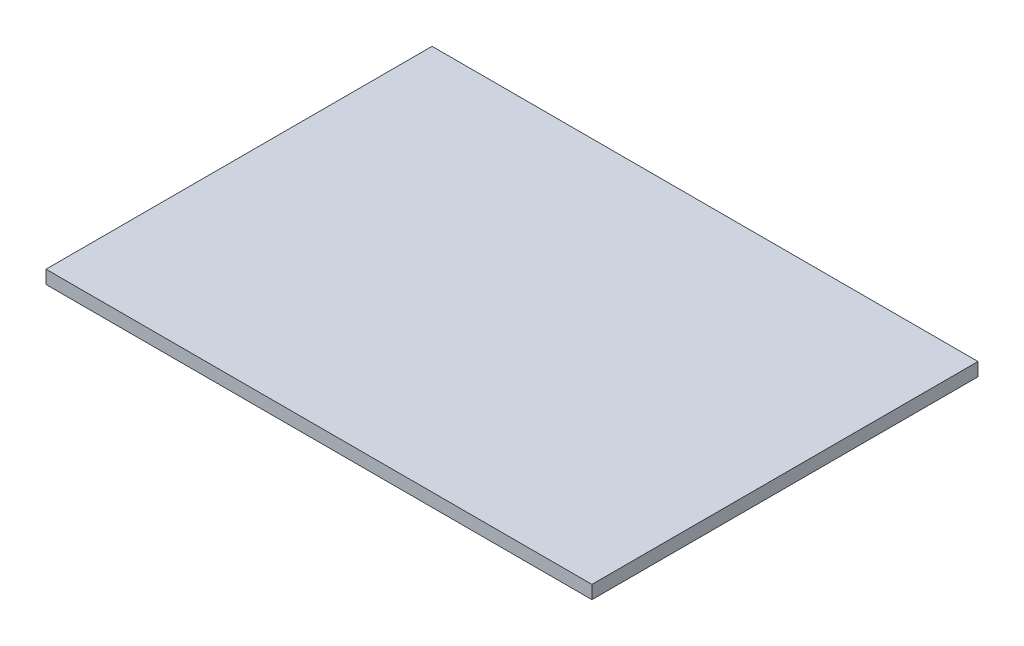
ISO-10303-21;
HEADER;
FILE_DESCRIPTION(('STEP AP214'),'2;1');
FILE_NAME('part.step','',(''),(''),'','','');
FILE_SCHEMA(('AUTOMOTIVE_DESIGN { 1 0 10303 214 1 1 1 1 }'));
ENDSEC;
DATA;
#1=APPLICATION_CONTEXT('core data for automotive mechanical design processes');
#2=APPLICATION_PROTOCOL_DEFINITION('international standard','automotive_design',2000,#1);
#3=PRODUCT_CONTEXT('',#1,'mechanical');
#4=PRODUCT('Part','Part','',(#3));
#5=PRODUCT_RELATED_PRODUCT_CATEGORY('part','',(#4));
#6=PRODUCT_DEFINITION_FORMATION('','',#4);
#7=PRODUCT_DEFINITION_CONTEXT('part definition',#1,'design');
#8=PRODUCT_DEFINITION('design','',#6,#7);
#9=PRODUCT_DEFINITION_SHAPE('','',#8);
#10=(LENGTH_UNIT() NAMED_UNIT(*) SI_UNIT(.MILLI.,.METRE.));
#11=(NAMED_UNIT(*) PLANE_ANGLE_UNIT() SI_UNIT($,.RADIAN.));
#12=(NAMED_UNIT(*) SI_UNIT($,.STERADIAN.) SOLID_ANGLE_UNIT());
#13=UNCERTAINTY_MEASURE_WITH_UNIT(LENGTH_MEASURE(1.E-05),#10,'distance_accuracy_value','');
#14=(GEOMETRIC_REPRESENTATION_CONTEXT(3) GLOBAL_UNCERTAINTY_ASSIGNED_CONTEXT((#13)) GLOBAL_UNIT_ASSIGNED_CONTEXT((#10,
#11,#12)) REPRESENTATION_CONTEXT('',''));
#15=CARTESIAN_POINT('',(0.,0.,0.));
#16=DIRECTION('',(0.,0.,1.));
#17=DIRECTION('',(1.,0.,0.));
#18=AXIS2_PLACEMENT_3D('',#15,#16,#17);
#19=CARTESIAN_POINT('',(228.949767436802,268.379236304719,53.9362891703796));
#20=DIRECTION('',(0.,0.,1.));
#21=DIRECTION('',(0.,-1.,0.));
#22=AXIS2_PLACEMENT_3D('',#19,#20,#21);
#23=PLANE('',#22);
#24=DIRECTION('',(1.,0.,0.));
#25=VECTOR('',#24,1.);
#26=CARTESIAN_POINT('',(228.949767436802,271.538999999998,53.9362891703797));
#27=LINE('',#26,#25);
#28=CARTESIAN_POINT('',(228.949767436802,271.538999999998,53.9362891703797));
#29=VERTEX_POINT('',#28);
#30=CARTESIAN_POINT('',(359.050232563198,271.538999999998,53.9362891703798));
#31=VERTEX_POINT('',#30);
#32=EDGE_CURVE('E79',#29,#31,#27,.T.);
#33=ORIENTED_EDGE('',*,*,#32,.F.);
#34=DIRECTION('',(0.,1.,0.));
#35=VECTOR('',#34,1.);
#36=CARTESIAN_POINT('',(228.949767436802,268.379236304719,53.9362891703796));
#37=LINE('',#36,#35);
#38=CARTESIAN_POINT('',(228.949767436802,268.379236304719,53.9362891703796));
#39=VERTEX_POINT('',#38);
#40=EDGE_CURVE('E32',#39,#29,#37,.T.);
#41=ORIENTED_EDGE('',*,*,#40,.F.);
#42=DIRECTION('',(1.,0.,0.));
#43=VECTOR('',#42,1.);
#44=CARTESIAN_POINT('',(228.949767436802,268.379236304719,53.9362891703796));
#45=LINE('',#44,#43);
#46=CARTESIAN_POINT('',(359.050232563198,268.379236304719,53.9362891703797));
#47=VERTEX_POINT('',#46);
#48=EDGE_CURVE('E71',#39,#47,#45,.T.);
#49=ORIENTED_EDGE('',*,*,#48,.T.);
#50=DIRECTION('',(0.,1.,0.));
#51=VECTOR('',#50,1.);
#52=CARTESIAN_POINT('',(359.050232563198,268.379236304719,53.9362891703797));
#53=LINE('',#52,#51);
#54=EDGE_CURVE('E10',#47,#31,#53,.T.);
#55=ORIENTED_EDGE('',*,*,#54,.T.);
#56=EDGE_LOOP('',(#33,#41,#49,#55));
#57=FACE_BOUND('',#56,.T.);
#58=ADVANCED_FACE('F16',(#57),#23,.T.);
#59=CARTESIAN_POINT('',(359.050232563198,268.379236304719,53.9362891703797));
#60=DIRECTION('',(1.,0.,0.));
#61=DIRECTION('',(0.,0.,-1.));
#62=AXIS2_PLACEMENT_3D('',#59,#60,#61);
#63=PLANE('',#62);
#64=DIRECTION('',(0.,0.,-1.));
#65=VECTOR('',#64,1.);
#66=CARTESIAN_POINT('',(359.050232563198,271.538999999998,53.9362891703798));
#67=LINE('',#66,#65);
#68=CARTESIAN_POINT('',(359.050232563198,271.539000000001,-38.0641759560166));
#69=VERTEX_POINT('',#68);
#70=EDGE_CURVE('E82',#31,#69,#67,.T.);
#71=ORIENTED_EDGE('',*,*,#70,.F.);
#72=ORIENTED_EDGE('',*,*,#54,.F.);
#73=DIRECTION('',(0.,0.,-1.));
#74=VECTOR('',#73,1.);
#75=CARTESIAN_POINT('',(359.050232563198,268.379236304719,53.9362891703797));
#76=LINE('',#75,#74);
#77=CARTESIAN_POINT('',(359.050232563198,268.379236304723,-38.0641759560167));
#78=VERTEX_POINT('',#77);
#79=EDGE_CURVE('E67',#47,#78,#76,.T.);
#80=ORIENTED_EDGE('',*,*,#79,.T.);
#81=DIRECTION('',(0.,1.,0.));
#82=VECTOR('',#81,1.);
#83=CARTESIAN_POINT('',(359.050232563198,268.379236304723,-38.0641759560167));
#84=LINE('',#83,#82);
#85=EDGE_CURVE('E24',#78,#69,#84,.T.);
#86=ORIENTED_EDGE('',*,*,#85,.T.);
#87=EDGE_LOOP('',(#71,#72,#80,#86));
#88=FACE_BOUND('',#87,.T.);
#89=ADVANCED_FACE('F68',(#88),#63,.T.);
#90=CARTESIAN_POINT('',(359.050232563198,268.379236304723,-38.0641759560167));
#91=DIRECTION('',(0.,0.,-1.));
#92=DIRECTION('',(0.,1.,0.));
#93=AXIS2_PLACEMENT_3D('',#90,#91,#92);
#94=PLANE('',#93);
#95=DIRECTION('',(-1.,0.,0.));
#96=VECTOR('',#95,1.);
#97=CARTESIAN_POINT('',(359.050232563198,271.539000000001,-38.0641759560166));
#98=LINE('',#97,#96);
#99=CARTESIAN_POINT('',(228.949767436802,271.539000000001,-38.0641759560167));
#100=VERTEX_POINT('',#99);
#101=EDGE_CURVE('E65',#69,#100,#98,.T.);
#102=ORIENTED_EDGE('',*,*,#101,.F.);
#103=ORIENTED_EDGE('',*,*,#85,.F.);
#104=DIRECTION('',(-1.,0.,0.));
#105=VECTOR('',#104,1.);
#106=CARTESIAN_POINT('',(359.050232563198,268.379236304723,-38.0641759560167));
#107=LINE('',#106,#105);
#108=CARTESIAN_POINT('',(228.949767436802,268.379236304723,-38.0641759560168));
#109=VERTEX_POINT('',#108);
#110=EDGE_CURVE('E62',#78,#109,#107,.T.);
#111=ORIENTED_EDGE('',*,*,#110,.T.);
#112=DIRECTION('',(0.,1.,0.));
#113=VECTOR('',#112,1.);
#114=CARTESIAN_POINT('',(228.949767436802,268.379236304723,-38.0641759560168));
#115=LINE('',#114,#113);
#116=EDGE_CURVE('E48',#109,#100,#115,.T.);
#117=ORIENTED_EDGE('',*,*,#116,.T.);
#118=EDGE_LOOP('',(#102,#103,#111,#117));
#119=FACE_BOUND('',#118,.T.);
#120=ADVANCED_FACE('F60',(#119),#94,.T.);
#121=CARTESIAN_POINT('',(228.949767436802,268.379236304723,-38.0641759560168));
#122=DIRECTION('',(-1.,0.,0.));
#123=DIRECTION('',(0.,0.,1.));
#124=AXIS2_PLACEMENT_3D('',#121,#122,#123);
#125=PLANE('',#124);
#126=DIRECTION('',(0.,0.,1.));
#127=VECTOR('',#126,1.);
#128=CARTESIAN_POINT('',(228.949767436802,271.539000000001,-38.0641759560167));
#129=LINE('',#128,#127);
#130=EDGE_CURVE('E85',#100,#29,#129,.T.);
#131=ORIENTED_EDGE('',*,*,#130,.F.);
#132=ORIENTED_EDGE('',*,*,#116,.F.);
#133=DIRECTION('',(0.,0.,1.));
#134=VECTOR('',#133,1.);
#135=CARTESIAN_POINT('',(228.949767436802,268.379236304723,-38.0641759560168));
#136=LINE('',#135,#134);
#137=EDGE_CURVE('E74',#109,#39,#136,.T.);
#138=ORIENTED_EDGE('',*,*,#137,.T.);
#139=ORIENTED_EDGE('',*,*,#40,.T.);
#140=EDGE_LOOP('',(#131,#132,#138,#139));
#141=FACE_BOUND('',#140,.T.);
#142=ADVANCED_FACE('F96',(#141),#125,.T.);
#143=CARTESIAN_POINT('',(294.,268.379236304723,-36.5139433928185));
#144=DIRECTION('',(0.,1.,0.));
#145=DIRECTION('',(-1.,0.,0.));
#146=AXIS2_PLACEMENT_3D('',#143,#144,#145);
#147=PLANE('',#146);
#148=ORIENTED_EDGE('',*,*,#48,.F.);
#149=ORIENTED_EDGE('',*,*,#137,.F.);
#150=ORIENTED_EDGE('',*,*,#110,.F.);
#151=ORIENTED_EDGE('',*,*,#79,.F.);
#152=EDGE_LOOP('',(#148,#149,#150,#151));
#153=FACE_BOUND('',#152,.T.);
#154=ADVANCED_FACE('F73',(#153),#147,.F.);
#155=CARTESIAN_POINT('',(294.,271.539000000001,-36.5139433928184));
#156=DIRECTION('',(0.,1.,0.));
#157=DIRECTION('',(-1.,0.,0.));
#158=AXIS2_PLACEMENT_3D('',#155,#156,#157);
#159=PLANE('',#158);
#160=ORIENTED_EDGE('',*,*,#32,.T.);
#161=ORIENTED_EDGE('',*,*,#70,.T.);
#162=ORIENTED_EDGE('',*,*,#101,.T.);
#163=ORIENTED_EDGE('',*,*,#130,.T.);
#164=EDGE_LOOP('',(#160,#161,#162,#163));
#165=FACE_BOUND('',#164,.T.);
#166=ADVANCED_FACE('F89',(#165),#159,.T.);
#167=CLOSED_SHELL('',(#58,#89,#120,#142,#154,#166));
#168=MANIFOLD_SOLID_BREP('B1',#167);
#169=ADVANCED_BREP_SHAPE_REPRESENTATION('',(#18,#168),#14);
#170=SHAPE_DEFINITION_REPRESENTATION(#9,#169);
ENDSEC;
END-ISO-10303-21;
